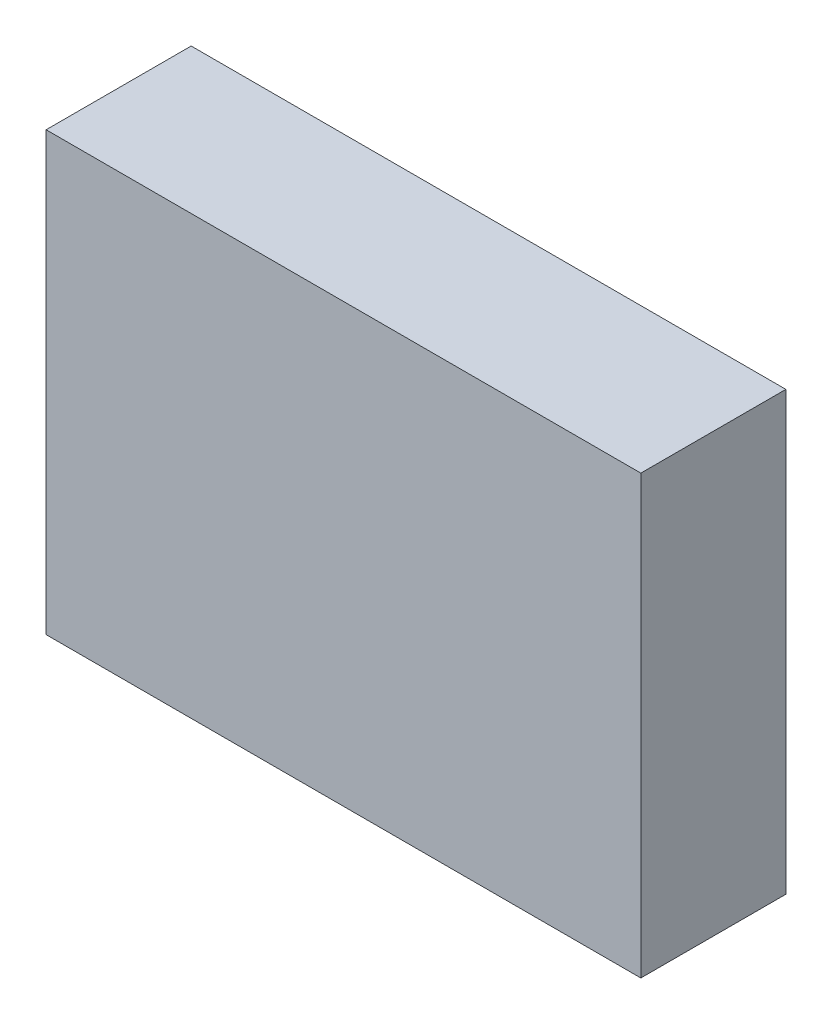
ISO-10303-21;
HEADER;
FILE_DESCRIPTION(('STEP AP214'),'2;1');
FILE_NAME('part.step','',(''),(''),'','','');
FILE_SCHEMA(('AUTOMOTIVE_DESIGN { 1 0 10303 214 1 1 1 1 }'));
ENDSEC;
DATA;
#1=APPLICATION_CONTEXT('core data for automotive mechanical design processes');
#2=APPLICATION_PROTOCOL_DEFINITION('international standard','automotive_design',2000,#1);
#3=PRODUCT_CONTEXT('',#1,'mechanical');
#4=PRODUCT('Part','Part','',(#3));
#5=PRODUCT_RELATED_PRODUCT_CATEGORY('part','',(#4));
#6=PRODUCT_DEFINITION_FORMATION('','',#4);
#7=PRODUCT_DEFINITION_CONTEXT('part definition',#1,'design');
#8=PRODUCT_DEFINITION('design','',#6,#7);
#9=PRODUCT_DEFINITION_SHAPE('','',#8);
#10=(LENGTH_UNIT() NAMED_UNIT(*) SI_UNIT(.MILLI.,.METRE.));
#11=(NAMED_UNIT(*) PLANE_ANGLE_UNIT() SI_UNIT($,.RADIAN.));
#12=(NAMED_UNIT(*) SI_UNIT($,.STERADIAN.) SOLID_ANGLE_UNIT());
#13=UNCERTAINTY_MEASURE_WITH_UNIT(LENGTH_MEASURE(1.E-05),#10,'distance_accuracy_value','');
#14=(GEOMETRIC_REPRESENTATION_CONTEXT(3) GLOBAL_UNCERTAINTY_ASSIGNED_CONTEXT((#13)) GLOBAL_UNIT_ASSIGNED_CONTEXT((#10,
#11,#12)) REPRESENTATION_CONTEXT('',''));
#15=CARTESIAN_POINT('',(0.,0.,0.));
#16=DIRECTION('',(0.,0.,1.));
#17=DIRECTION('',(1.,0.,0.));
#18=AXIS2_PLACEMENT_3D('',#15,#16,#17);
#19=CARTESIAN_POINT('',(-3.58775,2.63779,1.75006));
#20=DIRECTION('',(1.,0.,0.));
#21=DIRECTION('',(0.,0.,-1.));
#22=AXIS2_PLACEMENT_3D('',#19,#20,#21);
#23=PLANE('',#22);
#24=DIRECTION('',(0.,-1.,0.));
#25=VECTOR('',#24,1.);
#26=CARTESIAN_POINT('',(-3.58775,2.63779,0.));
#27=LINE('',#26,#25);
#28=CARTESIAN_POINT('',(-3.58775,2.63779,0.));
#29=VERTEX_POINT('',#28);
#30=CARTESIAN_POINT('',(-3.58775,-2.63779,0.));
#31=VERTEX_POINT('',#30);
#32=EDGE_CURVE('E95',#29,#31,#27,.T.);
#33=ORIENTED_EDGE('',*,*,#32,.T.);
#34=DIRECTION('',(0.,0.,-1.));
#35=VECTOR('',#34,1.);
#36=CARTESIAN_POINT('',(-3.58775,-2.63779,1.75006));
#37=LINE('',#36,#35);
#38=CARTESIAN_POINT('',(-3.58775,-2.63779,1.75006));
#39=VERTEX_POINT('',#38);
#40=EDGE_CURVE('E11',#39,#31,#37,.T.);
#41=ORIENTED_EDGE('',*,*,#40,.F.);
#42=DIRECTION('',(0.,-1.,0.));
#43=VECTOR('',#42,1.);
#44=CARTESIAN_POINT('',(-3.58775,2.63779,1.75006));
#45=LINE('',#44,#43);
#46=CARTESIAN_POINT('',(-3.58775,2.63779,1.75006));
#47=VERTEX_POINT('',#46);
#48=EDGE_CURVE('E83',#47,#39,#45,.T.);
#49=ORIENTED_EDGE('',*,*,#48,.F.);
#50=DIRECTION('',(0.,0.,-1.));
#51=VECTOR('',#50,1.);
#52=CARTESIAN_POINT('',(-3.58775,2.63779,1.75006));
#53=LINE('',#52,#51);
#54=EDGE_CURVE('E91',#47,#29,#53,.T.);
#55=ORIENTED_EDGE('',*,*,#54,.T.);
#56=EDGE_LOOP('',(#33,#41,#49,#55));
#57=FACE_BOUND('',#56,.T.);
#58=ADVANCED_FACE('F32',(#57),#23,.F.);
#59=CARTESIAN_POINT('',(-3.58775,-2.63779,1.75006));
#60=DIRECTION('',(0.,1.,0.));
#61=DIRECTION('',(0.,0.,1.));
#62=AXIS2_PLACEMENT_3D('',#59,#60,#61);
#63=PLANE('',#62);
#64=DIRECTION('',(1.,0.,0.));
#65=VECTOR('',#64,1.);
#66=CARTESIAN_POINT('',(-3.58775,-2.63779,0.));
#67=LINE('',#66,#65);
#68=CARTESIAN_POINT('',(3.58775,-2.63779,0.));
#69=VERTEX_POINT('',#68);
#70=EDGE_CURVE('E87',#31,#69,#67,.T.);
#71=ORIENTED_EDGE('',*,*,#70,.T.);
#72=DIRECTION('',(0.,0.,-1.));
#73=VECTOR('',#72,1.);
#74=CARTESIAN_POINT('',(3.58775,-2.63779,1.75006));
#75=LINE('',#74,#73);
#76=CARTESIAN_POINT('',(3.58775,-2.63779,1.75006));
#77=VERTEX_POINT('',#76);
#78=EDGE_CURVE('E40',#77,#69,#75,.T.);
#79=ORIENTED_EDGE('',*,*,#78,.F.);
#80=DIRECTION('',(1.,0.,0.));
#81=VECTOR('',#80,1.);
#82=CARTESIAN_POINT('',(-3.58775,-2.63779,1.75006));
#83=LINE('',#82,#81);
#84=EDGE_CURVE('E78',#39,#77,#83,.T.);
#85=ORIENTED_EDGE('',*,*,#84,.F.);
#86=ORIENTED_EDGE('',*,*,#40,.T.);
#87=EDGE_LOOP('',(#71,#79,#85,#86));
#88=FACE_BOUND('',#87,.T.);
#89=ADVANCED_FACE('F86',(#88),#63,.F.);
#90=CARTESIAN_POINT('',(3.58775,-2.63779,1.75006));
#91=DIRECTION('',(-1.,0.,0.));
#92=DIRECTION('',(0.,0.,1.));
#93=AXIS2_PLACEMENT_3D('',#90,#91,#92);
#94=PLANE('',#93);
#95=DIRECTION('',(0.,1.,0.));
#96=VECTOR('',#95,1.);
#97=CARTESIAN_POINT('',(3.58775,-2.63779,0.));
#98=LINE('',#97,#96);
#99=CARTESIAN_POINT('',(3.58775,2.63779,0.));
#100=VERTEX_POINT('',#99);
#101=EDGE_CURVE('E65',#69,#100,#98,.T.);
#102=ORIENTED_EDGE('',*,*,#101,.T.);
#103=DIRECTION('',(0.,0.,-1.));
#104=VECTOR('',#103,1.);
#105=CARTESIAN_POINT('',(3.58775,2.63779,1.75006));
#106=LINE('',#105,#104);
#107=CARTESIAN_POINT('',(3.58775,2.63779,1.75006));
#108=VERTEX_POINT('',#107);
#109=EDGE_CURVE('E88',#108,#100,#106,.T.);
#110=ORIENTED_EDGE('',*,*,#109,.F.);
#111=DIRECTION('',(0.,1.,0.));
#112=VECTOR('',#111,1.);
#113=CARTESIAN_POINT('',(3.58775,-2.63779,1.75006));
#114=LINE('',#113,#112);
#115=EDGE_CURVE('E81',#77,#108,#114,.T.);
#116=ORIENTED_EDGE('',*,*,#115,.F.);
#117=ORIENTED_EDGE('',*,*,#78,.T.);
#118=EDGE_LOOP('',(#102,#110,#116,#117));
#119=FACE_BOUND('',#118,.T.);
#120=ADVANCED_FACE('F89',(#119),#94,.F.);
#121=CARTESIAN_POINT('',(3.58775,2.63779,1.75006));
#122=DIRECTION('',(0.,-1.,0.));
#123=DIRECTION('',(0.,0.,-1.));
#124=AXIS2_PLACEMENT_3D('',#121,#122,#123);
#125=PLANE('',#124);
#126=DIRECTION('',(-1.,0.,0.));
#127=VECTOR('',#126,1.);
#128=CARTESIAN_POINT('',(3.58775,2.63779,0.));
#129=LINE('',#128,#127);
#130=EDGE_CURVE('E71',#100,#29,#129,.T.);
#131=ORIENTED_EDGE('',*,*,#130,.T.);
#132=ORIENTED_EDGE('',*,*,#54,.F.);
#133=DIRECTION('',(-1.,0.,0.));
#134=VECTOR('',#133,1.);
#135=CARTESIAN_POINT('',(3.58775,2.63779,1.75006));
#136=LINE('',#135,#134);
#137=EDGE_CURVE('E48',#108,#47,#136,.T.);
#138=ORIENTED_EDGE('',*,*,#137,.F.);
#139=ORIENTED_EDGE('',*,*,#109,.T.);
#140=EDGE_LOOP('',(#131,#132,#138,#139));
#141=FACE_BOUND('',#140,.T.);
#142=ADVANCED_FACE('F102',(#141),#125,.F.);
#143=CARTESIAN_POINT('',(0.,0.,1.75006));
#144=DIRECTION('',(0.,0.,1.));
#145=DIRECTION('',(1.,0.,0.));
#146=AXIS2_PLACEMENT_3D('',#143,#144,#145);
#147=PLANE('',#146);
#148=ORIENTED_EDGE('',*,*,#48,.T.);
#149=ORIENTED_EDGE('',*,*,#84,.T.);
#150=ORIENTED_EDGE('',*,*,#115,.T.);
#151=ORIENTED_EDGE('',*,*,#137,.T.);
#152=EDGE_LOOP('',(#148,#149,#150,#151));
#153=FACE_BOUND('',#152,.T.);
#154=ADVANCED_FACE('F79',(#153),#147,.T.);
#155=CARTESIAN_POINT('',(0.,0.,0.));
#156=DIRECTION('',(0.,0.,1.));
#157=DIRECTION('',(1.,0.,0.));
#158=AXIS2_PLACEMENT_3D('',#155,#156,#157);
#159=PLANE('',#158);
#160=ORIENTED_EDGE('',*,*,#32,.F.);
#161=ORIENTED_EDGE('',*,*,#130,.F.);
#162=ORIENTED_EDGE('',*,*,#101,.F.);
#163=ORIENTED_EDGE('',*,*,#70,.F.);
#164=EDGE_LOOP('',(#160,#161,#162,#163));
#165=FACE_BOUND('',#164,.T.);
#166=ADVANCED_FACE('F105',(#165),#159,.F.);
#167=CLOSED_SHELL('',(#58,#89,#120,#142,#154,#166));
#168=MANIFOLD_SOLID_BREP('B2',#167);
#169=ADVANCED_BREP_SHAPE_REPRESENTATION('',(#18,#168),#14);
#170=SHAPE_DEFINITION_REPRESENTATION(#9,#169);
ENDSEC;
END-ISO-10303-21;
